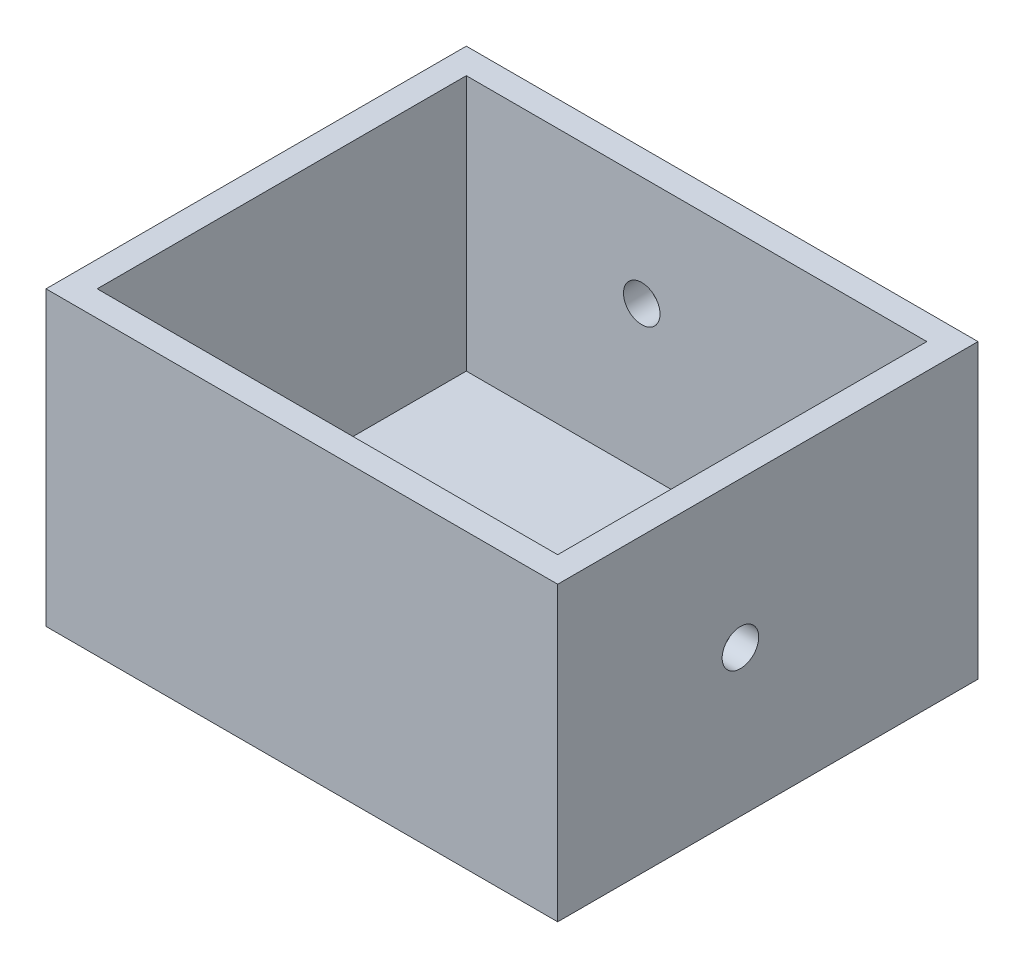
ISO-10303-21;
HEADER;
FILE_DESCRIPTION(('STEP AP214'),'2;1');
FILE_NAME('part.step','',(''),(''),'','','');
FILE_SCHEMA(('AUTOMOTIVE_DESIGN { 1 0 10303 214 1 1 1 1 }'));
ENDSEC;
DATA;
#1=APPLICATION_CONTEXT('core data for automotive mechanical design processes');
#2=APPLICATION_PROTOCOL_DEFINITION('international standard','automotive_design',2000,#1);
#3=PRODUCT_CONTEXT('',#1,'mechanical');
#4=PRODUCT('Part','Part','',(#3));
#5=PRODUCT_RELATED_PRODUCT_CATEGORY('part','',(#4));
#6=PRODUCT_DEFINITION_FORMATION('','',#4);
#7=PRODUCT_DEFINITION_CONTEXT('part definition',#1,'design');
#8=PRODUCT_DEFINITION('design','',#6,#7);
#9=PRODUCT_DEFINITION_SHAPE('','',#8);
#10=(LENGTH_UNIT() NAMED_UNIT(*) SI_UNIT(.MILLI.,.METRE.));
#11=(NAMED_UNIT(*) PLANE_ANGLE_UNIT() SI_UNIT($,.RADIAN.));
#12=(NAMED_UNIT(*) SI_UNIT($,.STERADIAN.) SOLID_ANGLE_UNIT());
#13=UNCERTAINTY_MEASURE_WITH_UNIT(LENGTH_MEASURE(1.E-05),#10,'distance_accuracy_value','');
#14=(GEOMETRIC_REPRESENTATION_CONTEXT(3) GLOBAL_UNCERTAINTY_ASSIGNED_CONTEXT((#13)) GLOBAL_UNIT_ASSIGNED_CONTEXT((#10,
#11,#12)) REPRESENTATION_CONTEXT('',''));
#15=CARTESIAN_POINT('',(0.,0.,0.));
#16=DIRECTION('',(0.,0.,1.));
#17=DIRECTION('',(1.,0.,0.));
#18=AXIS2_PLACEMENT_3D('',#15,#16,#17);
#19=CARTESIAN_POINT('',(-72.7163194444444,80.,61.4090686834094));
#20=DIRECTION('',(1.,0.,0.));
#21=DIRECTION('',(0.,0.,-1.));
#22=AXIS2_PLACEMENT_3D('',#19,#20,#21);
#23=PLANE('',#22);
#24=DIRECTION('',(0.,0.,1.));
#25=VECTOR('',#24,1.);
#26=CARTESIAN_POINT('',(-72.7163194444444,0.,61.4090686834094));
#27=LINE('',#26,#25);
#28=CARTESIAN_POINT('',(-72.7163194444444,0.,-53.5909313165906));
#29=VERTEX_POINT('',#28);
#30=CARTESIAN_POINT('',(-72.7163194444444,0.,61.4090686834094));
#31=VERTEX_POINT('',#30);
#32=EDGE_CURVE('E148',#29,#31,#27,.T.);
#33=ORIENTED_EDGE('',*,*,#32,.T.);
#34=DIRECTION('',(0.,-1.,0.));
#35=VECTOR('',#34,1.);
#36=CARTESIAN_POINT('',(-72.7163194444444,80.,61.4090686834094));
#37=LINE('',#36,#35);
#38=CARTESIAN_POINT('',(-72.7163194444444,80.,61.4090686834094));
#39=VERTEX_POINT('',#38);
#40=EDGE_CURVE('E11',#39,#31,#37,.T.);
#41=ORIENTED_EDGE('',*,*,#40,.F.);
#42=DIRECTION('',(0.,0.,1.));
#43=VECTOR('',#42,1.);
#44=CARTESIAN_POINT('',(-72.7163194444444,80.,61.4090686834094));
#45=LINE('',#44,#43);
#46=CARTESIAN_POINT('',(-72.7163194444444,80.,-53.5909313165906));
#47=VERTEX_POINT('',#46);
#48=EDGE_CURVE('E152',#47,#39,#45,.T.);
#49=ORIENTED_EDGE('',*,*,#48,.F.);
#50=DIRECTION('',(0.,-1.,0.));
#51=VECTOR('',#50,1.);
#52=CARTESIAN_POINT('',(-72.7163194444444,80.,-53.5909313165906));
#53=LINE('',#52,#51);
#54=EDGE_CURVE('E158',#47,#29,#53,.T.);
#55=ORIENTED_EDGE('',*,*,#54,.T.);
#56=EDGE_LOOP('',(#33,#41,#49,#55));
#57=FACE_BOUND('',#56,.T.);
#58=ADVANCED_FACE('F34',(#57),#23,.F.);
#59=CARTESIAN_POINT('',(-72.7163194444444,80.,61.4090686834094));
#60=DIRECTION('',(0.,0.,-1.));
#61=DIRECTION('',(-1.,0.,0.));
#62=AXIS2_PLACEMENT_3D('',#59,#60,#61);
#63=PLANE('',#62);
#64=DIRECTION('',(1.,0.,0.));
#65=VECTOR('',#64,1.);
#66=CARTESIAN_POINT('',(-72.7163194444444,0.,61.4090686834094));
#67=LINE('',#66,#65);
#68=CARTESIAN_POINT('',(67.2836805555556,0.,61.4090686834094));
#69=VERTEX_POINT('',#68);
#70=EDGE_CURVE('E161',#31,#69,#67,.T.);
#71=ORIENTED_EDGE('',*,*,#70,.T.);
#72=DIRECTION('',(0.,-1.,0.));
#73=VECTOR('',#72,1.);
#74=CARTESIAN_POINT('',(67.2836805555556,80.,61.4090686834094));
#75=LINE('',#74,#73);
#76=CARTESIAN_POINT('',(67.2836805555556,80.,61.4090686834094));
#77=VERTEX_POINT('',#76);
#78=EDGE_CURVE('E42',#77,#69,#75,.T.);
#79=ORIENTED_EDGE('',*,*,#78,.F.);
#80=DIRECTION('',(1.,0.,0.));
#81=VECTOR('',#80,1.);
#82=CARTESIAN_POINT('',(-72.7163194444444,80.,61.4090686834094));
#83=LINE('',#82,#81);
#84=EDGE_CURVE('E87',#39,#77,#83,.T.);
#85=ORIENTED_EDGE('',*,*,#84,.F.);
#86=ORIENTED_EDGE('',*,*,#40,.T.);
#87=EDGE_LOOP('',(#71,#79,#85,#86));
#88=FACE_BOUND('',#87,.T.);
#89=ADVANCED_FACE('F194',(#88),#63,.F.);
#90=CARTESIAN_POINT('',(67.2836805555556,80.,61.4090686834094));
#91=DIRECTION('',(-1.,0.,0.));
#92=DIRECTION('',(0.,0.,1.));
#93=AXIS2_PLACEMENT_3D('',#90,#91,#92);
#94=PLANE('',#93);
#95=CARTESIAN_POINT('',(67.2836805555556,40.,11.4090686834094));
#96=DIRECTION('',(1.,0.,0.));
#97=DIRECTION('',(0.,0.,-1.));
#98=AXIS2_PLACEMENT_3D('',#95,#96,#97);
#99=CIRCLE('',#98,5.);
#100=CARTESIAN_POINT('',(67.2836805555556,40.,6.40906868340944));
#101=VERTEX_POINT('',#100);
#102=EDGE_CURVE('E182',#101,#101,#99,.T.);
#103=ORIENTED_EDGE('',*,*,#102,.F.);
#104=EDGE_LOOP('',(#103));
#105=FACE_BOUND('',#104,.T.);
#106=DIRECTION('',(0.,0.,-1.));
#107=VECTOR('',#106,1.);
#108=CARTESIAN_POINT('',(67.2836805555556,0.,61.4090686834094));
#109=LINE('',#108,#107);
#110=CARTESIAN_POINT('',(67.2836805555556,0.,-53.5909313165906));
#111=VERTEX_POINT('',#110);
#112=EDGE_CURVE('E163',#69,#111,#109,.T.);
#113=ORIENTED_EDGE('',*,*,#112,.T.);
#114=DIRECTION('',(0.,-1.,0.));
#115=VECTOR('',#114,1.);
#116=CARTESIAN_POINT('',(67.2836805555556,80.,-53.5909313165906));
#117=LINE('',#116,#115);
#118=CARTESIAN_POINT('',(67.2836805555556,80.,-53.5909313165906));
#119=VERTEX_POINT('',#118);
#120=EDGE_CURVE('E167',#119,#111,#117,.T.);
#121=ORIENTED_EDGE('',*,*,#120,.F.);
#122=DIRECTION('',(0.,0.,-1.));
#123=VECTOR('',#122,1.);
#124=CARTESIAN_POINT('',(67.2836805555556,80.,61.4090686834094));
#125=LINE('',#124,#123);
#126=EDGE_CURVE('E155',#77,#119,#125,.T.);
#127=ORIENTED_EDGE('',*,*,#126,.F.);
#128=ORIENTED_EDGE('',*,*,#78,.T.);
#129=EDGE_LOOP('',(#113,#121,#127,#128));
#130=FACE_BOUND('',#129,.T.);
#131=ADVANCED_FACE('F190',(#105,#130),#94,.F.);
#132=CARTESIAN_POINT('',(-72.7163194444444,80.,-53.5909313165906));
#133=DIRECTION('',(0.,0.,1.));
#134=DIRECTION('',(1.,0.,0.));
#135=AXIS2_PLACEMENT_3D('',#132,#133,#134);
#136=PLANE('',#135);
#137=CARTESIAN_POINT('',(-17.7163194444444,50.,-53.5909313165906));
#138=DIRECTION('',(0.,0.,-1.));
#139=DIRECTION('',(-1.,0.,0.));
#140=AXIS2_PLACEMENT_3D('',#137,#138,#139);
#141=CIRCLE('',#140,5.);
#142=CARTESIAN_POINT('',(-22.7163194444444,50.,-53.5909313165906));
#143=VERTEX_POINT('',#142);
#144=EDGE_CURVE('E174',#143,#143,#141,.T.);
#145=ORIENTED_EDGE('',*,*,#144,.F.);
#146=EDGE_LOOP('',(#145));
#147=FACE_BOUND('',#146,.T.);
#148=CARTESIAN_POINT('',(42.2836805555556,50.,-53.5909313165906));
#149=DIRECTION('',(0.,0.,-1.));
#150=DIRECTION('',(-1.,0.,0.));
#151=AXIS2_PLACEMENT_3D('',#148,#149,#150);
#152=CIRCLE('',#151,5.);
#153=CARTESIAN_POINT('',(37.2836805555556,50.,-53.5909313165906));
#154=VERTEX_POINT('',#153);
#155=EDGE_CURVE('E135',#154,#154,#152,.T.);
#156=ORIENTED_EDGE('',*,*,#155,.F.);
#157=EDGE_LOOP('',(#156));
#158=FACE_BOUND('',#157,.T.);
#159=DIRECTION('',(-1.,0.,0.));
#160=VECTOR('',#159,1.);
#161=CARTESIAN_POINT('',(-72.7163194444444,0.,-53.5909313165906));
#162=LINE('',#161,#160);
#163=EDGE_CURVE('E80',#111,#29,#162,.T.);
#164=ORIENTED_EDGE('',*,*,#163,.T.);
#165=ORIENTED_EDGE('',*,*,#54,.F.);
#166=DIRECTION('',(-1.,0.,0.));
#167=VECTOR('',#166,1.);
#168=CARTESIAN_POINT('',(-72.7163194444444,80.,-53.5909313165906));
#169=LINE('',#168,#167);
#170=EDGE_CURVE('E59',#119,#47,#169,.T.);
#171=ORIENTED_EDGE('',*,*,#170,.F.);
#172=ORIENTED_EDGE('',*,*,#120,.T.);
#173=EDGE_LOOP('',(#164,#165,#171,#172));
#174=FACE_BOUND('',#173,.T.);
#175=ADVANCED_FACE('F193',(#147,#158,#174),#136,.F.);
#176=CARTESIAN_POINT('',(0.,80.,0.));
#177=DIRECTION('',(0.,-1.,0.));
#178=DIRECTION('',(0.,0.,-1.));
#179=AXIS2_PLACEMENT_3D('',#176,#177,#178);
#180=PLANE('',#179);
#181=DIRECTION('',(1.,0.,0.));
#182=VECTOR('',#181,1.);
#183=CARTESIAN_POINT('',(-65.7163194444444,80.,54.4090686834094));
#184=LINE('',#183,#182);
#185=CARTESIAN_POINT('',(-65.7163194444444,80.,54.4090686834094));
#186=VERTEX_POINT('',#185);
#187=CARTESIAN_POINT('',(60.2836805555556,80.,54.4090686834094));
#188=VERTEX_POINT('',#187);
#189=EDGE_CURVE('E141',#186,#188,#184,.T.);
#190=ORIENTED_EDGE('',*,*,#189,.F.);
#191=DIRECTION('',(0.,0.,1.));
#192=VECTOR('',#191,1.);
#193=CARTESIAN_POINT('',(-65.7163194444444,80.,54.4090686834094));
#194=LINE('',#193,#192);
#195=CARTESIAN_POINT('',(-65.7163194444444,80.,-46.5909313165906));
#196=VERTEX_POINT('',#195);
#197=EDGE_CURVE('E50',#196,#186,#194,.T.);
#198=ORIENTED_EDGE('',*,*,#197,.F.);
#199=DIRECTION('',(-1.,0.,0.));
#200=VECTOR('',#199,1.);
#201=CARTESIAN_POINT('',(-65.7163194444444,80.,-46.5909313165906));
#202=LINE('',#201,#200);
#203=CARTESIAN_POINT('',(60.2836805555556,80.,-46.5909313165906));
#204=VERTEX_POINT('',#203);
#205=EDGE_CURVE('E129',#204,#196,#202,.T.);
#206=ORIENTED_EDGE('',*,*,#205,.F.);
#207=DIRECTION('',(0.,0.,-1.));
#208=VECTOR('',#207,1.);
#209=CARTESIAN_POINT('',(60.2836805555556,80.,54.4090686834094));
#210=LINE('',#209,#208);
#211=EDGE_CURVE('E132',#188,#204,#210,.T.);
#212=ORIENTED_EDGE('',*,*,#211,.F.);
#213=EDGE_LOOP('',(#190,#198,#206,#212));
#214=FACE_BOUND('',#213,.T.);
#215=ORIENTED_EDGE('',*,*,#48,.T.);
#216=ORIENTED_EDGE('',*,*,#84,.T.);
#217=ORIENTED_EDGE('',*,*,#126,.T.);
#218=ORIENTED_EDGE('',*,*,#170,.T.);
#219=EDGE_LOOP('',(#215,#216,#217,#218));
#220=FACE_BOUND('',#219,.T.);
#221=ADVANCED_FACE('F205',(#214,#220),#180,.F.);
#222=CARTESIAN_POINT('',(0.,0.,0.));
#223=DIRECTION('',(0.,-1.,0.));
#224=DIRECTION('',(0.,0.,-1.));
#225=AXIS2_PLACEMENT_3D('',#222,#223,#224);
#226=PLANE('',#225);
#227=ORIENTED_EDGE('',*,*,#32,.F.);
#228=ORIENTED_EDGE('',*,*,#163,.F.);
#229=ORIENTED_EDGE('',*,*,#112,.F.);
#230=ORIENTED_EDGE('',*,*,#70,.F.);
#231=EDGE_LOOP('',(#227,#228,#229,#230));
#232=FACE_BOUND('',#231,.T.);
#233=ADVANCED_FACE('F201',(#232),#226,.T.);
#234=CARTESIAN_POINT('',(-65.7163194444444,9.99999999999999,54.4090686834094));
#235=DIRECTION('',(-1.,0.,0.));
#236=DIRECTION('',(0.,0.,1.));
#237=AXIS2_PLACEMENT_3D('',#234,#235,#236);
#238=PLANE('',#237);
#239=ORIENTED_EDGE('',*,*,#197,.T.);
#240=DIRECTION('',(0.,1.,0.));
#241=VECTOR('',#240,1.);
#242=CARTESIAN_POINT('',(-65.7163194444444,9.99999999999999,54.4090686834094));
#243=LINE('',#242,#241);
#244=CARTESIAN_POINT('',(-65.7163194444444,9.99999999999999,54.4090686834094));
#245=VERTEX_POINT('',#244);
#246=EDGE_CURVE('E107',#245,#186,#243,.T.);
#247=ORIENTED_EDGE('',*,*,#246,.F.);
#248=DIRECTION('',(0.,0.,1.));
#249=VECTOR('',#248,1.);
#250=CARTESIAN_POINT('',(-65.7163194444444,9.99999999999999,54.4090686834094));
#251=LINE('',#250,#249);
#252=CARTESIAN_POINT('',(-65.7163194444444,9.99999999999999,-46.5909313165906));
#253=VERTEX_POINT('',#252);
#254=EDGE_CURVE('E111',#253,#245,#251,.T.);
#255=ORIENTED_EDGE('',*,*,#254,.F.);
#256=DIRECTION('',(0.,1.,0.));
#257=VECTOR('',#256,1.);
#258=CARTESIAN_POINT('',(-65.7163194444444,9.99999999999999,-46.5909313165906));
#259=LINE('',#258,#257);
#260=EDGE_CURVE('E146',#253,#196,#259,.T.);
#261=ORIENTED_EDGE('',*,*,#260,.T.);
#262=EDGE_LOOP('',(#239,#247,#255,#261));
#263=FACE_BOUND('',#262,.T.);
#264=ADVANCED_FACE('F109',(#263),#238,.F.);
#265=CARTESIAN_POINT('',(-65.7163194444444,9.99999999999999,-46.5909313165906));
#266=DIRECTION('',(0.,0.,-1.));
#267=DIRECTION('',(-1.,0.,0.));
#268=AXIS2_PLACEMENT_3D('',#265,#266,#267);
#269=PLANE('',#268);
#270=CARTESIAN_POINT('',(-17.7163194444444,50.,-46.5909313165906));
#271=DIRECTION('',(0.,0.,-1.));
#272=DIRECTION('',(-1.,0.,0.));
#273=AXIS2_PLACEMENT_3D('',#270,#271,#272);
#274=CIRCLE('',#273,5.);
#275=CARTESIAN_POINT('',(-22.7163194444444,50.,-46.5909313165906));
#276=VERTEX_POINT('',#275);
#277=EDGE_CURVE('E172',#276,#276,#274,.T.);
#278=ORIENTED_EDGE('',*,*,#277,.T.);
#279=EDGE_LOOP('',(#278));
#280=FACE_BOUND('',#279,.T.);
#281=CARTESIAN_POINT('',(42.2836805555556,50.,-46.5909313165906));
#282=DIRECTION('',(0.,0.,-1.));
#283=DIRECTION('',(-1.,0.,0.));
#284=AXIS2_PLACEMENT_3D('',#281,#282,#283);
#285=CIRCLE('',#284,5.);
#286=CARTESIAN_POINT('',(37.2836805555556,50.,-46.5909313165906));
#287=VERTEX_POINT('',#286);
#288=EDGE_CURVE('E142',#287,#287,#285,.T.);
#289=ORIENTED_EDGE('',*,*,#288,.T.);
#290=EDGE_LOOP('',(#289));
#291=FACE_BOUND('',#290,.T.);
#292=ORIENTED_EDGE('',*,*,#205,.T.);
#293=ORIENTED_EDGE('',*,*,#260,.F.);
#294=DIRECTION('',(-1.,0.,0.));
#295=VECTOR('',#294,1.);
#296=CARTESIAN_POINT('',(-65.7163194444444,9.99999999999999,-46.5909313165906));
#297=LINE('',#296,#295);
#298=CARTESIAN_POINT('',(60.2836805555556,9.99999999999999,-46.5909313165906));
#299=VERTEX_POINT('',#298);
#300=EDGE_CURVE('E117',#299,#253,#297,.T.);
#301=ORIENTED_EDGE('',*,*,#300,.F.);
#302=DIRECTION('',(0.,1.,0.));
#303=VECTOR('',#302,1.);
#304=CARTESIAN_POINT('',(60.2836805555556,9.99999999999999,-46.5909313165906));
#305=LINE('',#304,#303);
#306=EDGE_CURVE('E149',#299,#204,#305,.T.);
#307=ORIENTED_EDGE('',*,*,#306,.T.);
#308=EDGE_LOOP('',(#292,#293,#301,#307));
#309=FACE_BOUND('',#308,.T.);
#310=ADVANCED_FACE('F221',(#280,#291,#309),#269,.F.);
#311=CARTESIAN_POINT('',(60.2836805555556,9.99999999999999,54.4090686834094));
#312=DIRECTION('',(1.,0.,0.));
#313=DIRECTION('',(0.,0.,-1.));
#314=AXIS2_PLACEMENT_3D('',#311,#312,#313);
#315=PLANE('',#314);
#316=CARTESIAN_POINT('',(60.2836805555556,40.,11.4090686834094));
#317=DIRECTION('',(1.,0.,0.));
#318=DIRECTION('',(0.,0.,-1.));
#319=AXIS2_PLACEMENT_3D('',#316,#317,#318);
#320=CIRCLE('',#319,5.);
#321=CARTESIAN_POINT('',(60.2836805555556,40.,6.40906868340944));
#322=VERTEX_POINT('',#321);
#323=EDGE_CURVE('E37',#322,#322,#320,.T.);
#324=ORIENTED_EDGE('',*,*,#323,.T.);
#325=EDGE_LOOP('',(#324));
#326=FACE_BOUND('',#325,.T.);
#327=ORIENTED_EDGE('',*,*,#211,.T.);
#328=ORIENTED_EDGE('',*,*,#306,.F.);
#329=DIRECTION('',(0.,0.,-1.));
#330=VECTOR('',#329,1.);
#331=CARTESIAN_POINT('',(60.2836805555556,9.99999999999999,54.4090686834094));
#332=LINE('',#331,#330);
#333=CARTESIAN_POINT('',(60.2836805555556,9.99999999999999,54.4090686834094));
#334=VERTEX_POINT('',#333);
#335=EDGE_CURVE('E125',#334,#299,#332,.T.);
#336=ORIENTED_EDGE('',*,*,#335,.F.);
#337=DIRECTION('',(0.,1.,0.));
#338=VECTOR('',#337,1.);
#339=CARTESIAN_POINT('',(60.2836805555556,9.99999999999999,54.4090686834094));
#340=LINE('',#339,#338);
#341=EDGE_CURVE('E116',#334,#188,#340,.T.);
#342=ORIENTED_EDGE('',*,*,#341,.T.);
#343=EDGE_LOOP('',(#327,#328,#336,#342));
#344=FACE_BOUND('',#343,.T.);
#345=ADVANCED_FACE('F224',(#326,#344),#315,.F.);
#346=CARTESIAN_POINT('',(-65.7163194444444,9.99999999999999,54.4090686834094));
#347=DIRECTION('',(0.,0.,1.));
#348=DIRECTION('',(1.,0.,0.));
#349=AXIS2_PLACEMENT_3D('',#346,#347,#348);
#350=PLANE('',#349);
#351=ORIENTED_EDGE('',*,*,#189,.T.);
#352=ORIENTED_EDGE('',*,*,#341,.F.);
#353=DIRECTION('',(1.,0.,0.));
#354=VECTOR('',#353,1.);
#355=CARTESIAN_POINT('',(-65.7163194444444,9.99999999999999,54.4090686834094));
#356=LINE('',#355,#354);
#357=EDGE_CURVE('E120',#245,#334,#356,.T.);
#358=ORIENTED_EDGE('',*,*,#357,.F.);
#359=ORIENTED_EDGE('',*,*,#246,.T.);
#360=EDGE_LOOP('',(#351,#352,#358,#359));
#361=FACE_BOUND('',#360,.T.);
#362=ADVANCED_FACE('F121',(#361),#350,.F.);
#363=CARTESIAN_POINT('',(0.,9.99999999999999,0.));
#364=DIRECTION('',(0.,-1.,0.));
#365=DIRECTION('',(0.,0.,-1.));
#366=AXIS2_PLACEMENT_3D('',#363,#364,#365);
#367=PLANE('',#366);
#368=ORIENTED_EDGE('',*,*,#254,.T.);
#369=ORIENTED_EDGE('',*,*,#357,.T.);
#370=ORIENTED_EDGE('',*,*,#335,.T.);
#371=ORIENTED_EDGE('',*,*,#300,.T.);
#372=EDGE_LOOP('',(#368,#369,#370,#371));
#373=FACE_BOUND('',#372,.T.);
#374=ADVANCED_FACE('F127',(#373),#367,.F.);
#375=CARTESIAN_POINT('',(42.2836805555556,50.,-53.5909313165906));
#376=DIRECTION('',(0.,0.,-1.));
#377=DIRECTION('',(-1.,0.,0.));
#378=AXIS2_PLACEMENT_3D('',#375,#376,#377);
#379=CYLINDRICAL_SURFACE('',#378,5.);
#380=ORIENTED_EDGE('',*,*,#155,.T.);
#381=EDGE_LOOP('',(#380));
#382=FACE_BOUND('',#381,.T.);
#383=ORIENTED_EDGE('',*,*,#288,.F.);
#384=EDGE_LOOP('',(#383));
#385=FACE_BOUND('',#384,.T.);
#386=ADVANCED_FACE('F232',(#382,#385),#379,.F.);
#387=CARTESIAN_POINT('',(-17.7163194444444,50.,-53.5909313165906));
#388=DIRECTION('',(0.,0.,-1.));
#389=DIRECTION('',(-1.,0.,0.));
#390=AXIS2_PLACEMENT_3D('',#387,#388,#389);
#391=CYLINDRICAL_SURFACE('',#390,5.);
#392=ORIENTED_EDGE('',*,*,#144,.T.);
#393=EDGE_LOOP('',(#392));
#394=FACE_BOUND('',#393,.T.);
#395=ORIENTED_EDGE('',*,*,#277,.F.);
#396=EDGE_LOOP('',(#395));
#397=FACE_BOUND('',#396,.T.);
#398=ADVANCED_FACE('F235',(#394,#397),#391,.F.);
#399=CARTESIAN_POINT('',(67.2836805555556,40.,11.4090686834094));
#400=DIRECTION('',(1.,0.,0.));
#401=DIRECTION('',(0.,0.,-1.));
#402=AXIS2_PLACEMENT_3D('',#399,#400,#401);
#403=CYLINDRICAL_SURFACE('',#402,5.);
#404=ORIENTED_EDGE('',*,*,#102,.T.);
#405=EDGE_LOOP('',(#404));
#406=FACE_BOUND('',#405,.T.);
#407=ORIENTED_EDGE('',*,*,#323,.F.);
#408=EDGE_LOOP('',(#407));
#409=FACE_BOUND('',#408,.T.);
#410=ADVANCED_FACE('F187',(#406,#409),#403,.F.);
#411=CLOSED_SHELL('',(#58,#89,#131,#175,#221,#233,#264,#310,#345,#362,#374,#386,#398,#410));
#412=MANIFOLD_SOLID_BREP('B2',#411);
#413=ADVANCED_BREP_SHAPE_REPRESENTATION('',(#18,#412),#14);
#414=SHAPE_DEFINITION_REPRESENTATION(#9,#413);
ENDSEC;
END-ISO-10303-21;
